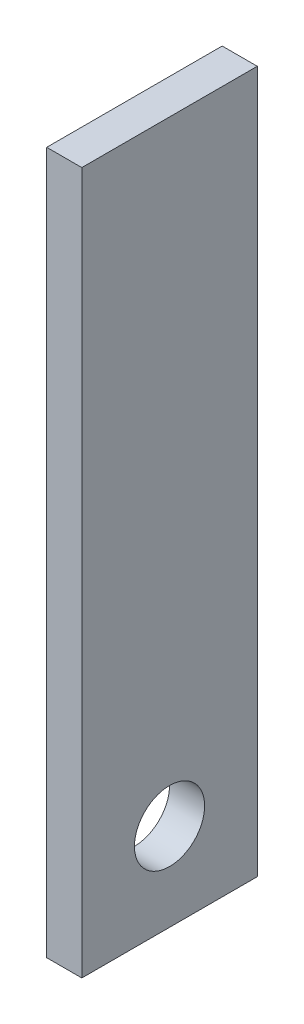
ISO-10303-21;
HEADER;
FILE_DESCRIPTION(('STEP AP214'),'2;1');
FILE_NAME('part.step','',(''),(''),'','','');
FILE_SCHEMA(('AUTOMOTIVE_DESIGN { 1 0 10303 214 1 1 1 1 }'));
ENDSEC;
DATA;
#1=APPLICATION_CONTEXT('core data for automotive mechanical design processes');
#2=APPLICATION_PROTOCOL_DEFINITION('international standard','automotive_design',2000,#1);
#3=PRODUCT_CONTEXT('',#1,'mechanical');
#4=PRODUCT('Part','Part','',(#3));
#5=PRODUCT_RELATED_PRODUCT_CATEGORY('part','',(#4));
#6=PRODUCT_DEFINITION_FORMATION('','',#4);
#7=PRODUCT_DEFINITION_CONTEXT('part definition',#1,'design');
#8=PRODUCT_DEFINITION('design','',#6,#7);
#9=PRODUCT_DEFINITION_SHAPE('','',#8);
#10=(LENGTH_UNIT() NAMED_UNIT(*) SI_UNIT(.MILLI.,.METRE.));
#11=(NAMED_UNIT(*) PLANE_ANGLE_UNIT() SI_UNIT($,.RADIAN.));
#12=(NAMED_UNIT(*) SI_UNIT($,.STERADIAN.) SOLID_ANGLE_UNIT());
#13=UNCERTAINTY_MEASURE_WITH_UNIT(LENGTH_MEASURE(1.E-05),#10,'distance_accuracy_value','');
#14=(GEOMETRIC_REPRESENTATION_CONTEXT(3) GLOBAL_UNCERTAINTY_ASSIGNED_CONTEXT((#13)) GLOBAL_UNIT_ASSIGNED_CONTEXT((#10,
#11,#12)) REPRESENTATION_CONTEXT('',''));
#15=CARTESIAN_POINT('',(0.,0.,0.));
#16=DIRECTION('',(0.,0.,1.));
#17=DIRECTION('',(1.,0.,0.));
#18=AXIS2_PLACEMENT_3D('',#15,#16,#17);
#19=CARTESIAN_POINT('',(5.00000000000002,-200.,0.));
#20=DIRECTION('',(0.,1.,0.));
#21=DIRECTION('',(-1.,0.,0.));
#22=AXIS2_PLACEMENT_3D('',#19,#20,#21);
#23=PLANE('',#22);
#24=DIRECTION('',(1.,0.,0.));
#25=VECTOR('',#24,1.);
#26=CARTESIAN_POINT('',(-43.,-200.000000000001,-25.));
#27=LINE('',#26,#25);
#28=CARTESIAN_POINT('',(-53.,-200.,-25.0000000000002));
#29=VERTEX_POINT('',#28);
#30=CARTESIAN_POINT('',(-43.,-200.000000000001,-25.));
#31=VERTEX_POINT('',#30);
#32=EDGE_CURVE('E119',#29,#31,#27,.T.);
#33=ORIENTED_EDGE('',*,*,#32,.T.);
#34=DIRECTION('',(0.,0.,1.));
#35=VECTOR('',#34,1.);
#36=CARTESIAN_POINT('',(-43.,-200.000000000001,-25.));
#37=LINE('',#36,#35);
#38=CARTESIAN_POINT('',(-43.,-200.,25.));
#39=VERTEX_POINT('',#38);
#40=EDGE_CURVE('E116',#31,#39,#37,.T.);
#41=ORIENTED_EDGE('',*,*,#40,.T.);
#42=DIRECTION('',(-1.,0.,0.));
#43=VECTOR('',#42,1.);
#44=CARTESIAN_POINT('',(-53.,-200.,25.0000000000002));
#45=LINE('',#44,#43);
#46=CARTESIAN_POINT('',(-53.,-200.,25.0000000000002));
#47=VERTEX_POINT('',#46);
#48=EDGE_CURVE('E130',#39,#47,#45,.T.);
#49=ORIENTED_EDGE('',*,*,#48,.T.);
#50=DIRECTION('',(0.,0.,-1.));
#51=VECTOR('',#50,1.);
#52=CARTESIAN_POINT('',(-53.,-200.,-25.0000000000002));
#53=LINE('',#52,#51);
#54=EDGE_CURVE('E64',#47,#29,#53,.T.);
#55=ORIENTED_EDGE('',*,*,#54,.T.);
#56=EDGE_LOOP('',(#33,#41,#49,#55));
#57=FACE_BOUND('',#56,.T.);
#58=ADVANCED_FACE('F40',(#57),#23,.F.);
#59=CARTESIAN_POINT('',(-53.,-200.,-25.0000000000002));
#60=DIRECTION('',(1.,0.,0.));
#61=DIRECTION('',(0.,1.,0.));
#62=AXIS2_PLACEMENT_3D('',#59,#60,#61);
#63=PLANE('',#62);
#64=CARTESIAN_POINT('',(-53.,-175.,0.));
#65=DIRECTION('',(-1.,0.,0.));
#66=DIRECTION('',(0.,0.,1.));
#67=AXIS2_PLACEMENT_3D('',#64,#65,#66);
#68=CIRCLE('',#67,9.99999999999998);
#69=CARTESIAN_POINT('',(-53.,-175.,10.0000000000001));
#70=VERTEX_POINT('',#69);
#71=EDGE_CURVE('E139',#70,#70,#68,.T.);
#72=ORIENTED_EDGE('',*,*,#71,.F.);
#73=EDGE_LOOP('',(#72));
#74=FACE_BOUND('',#73,.T.);
#75=DIRECTION('',(0.,0.,1.));
#76=VECTOR('',#75,1.);
#77=CARTESIAN_POINT('',(-53.,0.,-25.));
#78=LINE('',#77,#76);
#79=CARTESIAN_POINT('',(-53.,0.,-25.));
#80=VERTEX_POINT('',#79);
#81=CARTESIAN_POINT('',(-53.,0.,25.0000000000001));
#82=VERTEX_POINT('',#81);
#83=EDGE_CURVE('E11',#80,#82,#78,.T.);
#84=ORIENTED_EDGE('',*,*,#83,.F.);
#85=DIRECTION('',(0.,1.,0.));
#86=VECTOR('',#85,1.);
#87=CARTESIAN_POINT('',(-53.,-200.,-25.0000000000002));
#88=LINE('',#87,#86);
#89=EDGE_CURVE('E99',#29,#80,#88,.T.);
#90=ORIENTED_EDGE('',*,*,#89,.F.);
#91=ORIENTED_EDGE('',*,*,#54,.F.);
#92=DIRECTION('',(0.,1.,0.));
#93=VECTOR('',#92,1.);
#94=CARTESIAN_POINT('',(-53.,-200.,25.0000000000002));
#95=LINE('',#94,#93);
#96=EDGE_CURVE('E92',#47,#82,#95,.T.);
#97=ORIENTED_EDGE('',*,*,#96,.T.);
#98=EDGE_LOOP('',(#84,#90,#91,#97));
#99=FACE_BOUND('',#98,.T.);
#100=ADVANCED_FACE('F97',(#74,#99),#63,.F.);
#101=CARTESIAN_POINT('',(-53.,-200.,25.0000000000002));
#102=DIRECTION('',(0.,0.,-1.));
#103=DIRECTION('',(-1.,0.,0.));
#104=AXIS2_PLACEMENT_3D('',#101,#102,#103);
#105=PLANE('',#104);
#106=DIRECTION('',(1.,0.,0.));
#107=VECTOR('',#106,1.);
#108=CARTESIAN_POINT('',(-53.,0.,25.0000000000001));
#109=LINE('',#108,#107);
#110=CARTESIAN_POINT('',(-43.,0.,25.0000000000001));
#111=VERTEX_POINT('',#110);
#112=EDGE_CURVE('E82',#82,#111,#109,.T.);
#113=ORIENTED_EDGE('',*,*,#112,.F.);
#114=ORIENTED_EDGE('',*,*,#96,.F.);
#115=ORIENTED_EDGE('',*,*,#48,.F.);
#116=DIRECTION('',(0.,1.,0.));
#117=VECTOR('',#116,1.);
#118=CARTESIAN_POINT('',(-43.,-200.,25.));
#119=LINE('',#118,#117);
#120=EDGE_CURVE('E94',#39,#111,#119,.T.);
#121=ORIENTED_EDGE('',*,*,#120,.T.);
#122=EDGE_LOOP('',(#113,#114,#115,#121));
#123=FACE_BOUND('',#122,.T.);
#124=ADVANCED_FACE('F90',(#123),#105,.F.);
#125=CARTESIAN_POINT('',(-43.,-200.000000000001,-25.));
#126=DIRECTION('',(-1.,0.,0.));
#127=DIRECTION('',(0.,-1.,0.));
#128=AXIS2_PLACEMENT_3D('',#125,#126,#127);
#129=PLANE('',#128);
#130=CARTESIAN_POINT('',(-43.,-175.,0.));
#131=DIRECTION('',(-1.,0.,0.));
#132=DIRECTION('',(0.,-1.,0.));
#133=AXIS2_PLACEMENT_3D('',#130,#131,#132);
#134=CIRCLE('',#133,9.99999999999998);
#135=CARTESIAN_POINT('',(-43.,-185.,0.));
#136=VERTEX_POINT('',#135);
#137=EDGE_CURVE('E44',#136,#136,#134,.T.);
#138=ORIENTED_EDGE('',*,*,#137,.T.);
#139=EDGE_LOOP('',(#138));
#140=FACE_BOUND('',#139,.T.);
#141=DIRECTION('',(0.,0.,-1.));
#142=VECTOR('',#141,1.);
#143=CARTESIAN_POINT('',(-43.,0.,-25.0000000000001));
#144=LINE('',#143,#142);
#145=CARTESIAN_POINT('',(-43.,0.,-25.));
#146=VERTEX_POINT('',#145);
#147=EDGE_CURVE('E115',#111,#146,#144,.T.);
#148=ORIENTED_EDGE('',*,*,#147,.F.);
#149=ORIENTED_EDGE('',*,*,#120,.F.);
#150=ORIENTED_EDGE('',*,*,#40,.F.);
#151=DIRECTION('',(0.,1.,0.));
#152=VECTOR('',#151,1.);
#153=CARTESIAN_POINT('',(-43.,-200.000000000001,-25.));
#154=LINE('',#153,#152);
#155=EDGE_CURVE('E50',#31,#146,#154,.T.);
#156=ORIENTED_EDGE('',*,*,#155,.T.);
#157=EDGE_LOOP('',(#148,#149,#150,#156));
#158=FACE_BOUND('',#157,.T.);
#159=ADVANCED_FACE('F114',(#140,#158),#129,.F.);
#160=CARTESIAN_POINT('',(-43.,-200.000000000001,-25.));
#161=DIRECTION('',(0.,0.,1.));
#162=DIRECTION('',(1.,0.,0.));
#163=AXIS2_PLACEMENT_3D('',#160,#161,#162);
#164=PLANE('',#163);
#165=DIRECTION('',(1.,0.,0.));
#166=VECTOR('',#165,1.);
#167=CARTESIAN_POINT('',(-53.,0.,-25.));
#168=LINE('',#167,#166);
#169=EDGE_CURVE('E56',#80,#146,#168,.T.);
#170=ORIENTED_EDGE('',*,*,#169,.T.);
#171=ORIENTED_EDGE('',*,*,#155,.F.);
#172=ORIENTED_EDGE('',*,*,#32,.F.);
#173=ORIENTED_EDGE('',*,*,#89,.T.);
#174=EDGE_LOOP('',(#170,#171,#172,#173));
#175=FACE_BOUND('',#174,.T.);
#176=ADVANCED_FACE('F42',(#175),#164,.F.);
#177=CARTESIAN_POINT('',(-53.,0.,-25.));
#178=DIRECTION('',(0.,1.,0.));
#179=DIRECTION('',(-1.,0.,0.));
#180=AXIS2_PLACEMENT_3D('',#177,#178,#179);
#181=PLANE('',#180);
#182=ORIENTED_EDGE('',*,*,#147,.T.);
#183=ORIENTED_EDGE('',*,*,#169,.F.);
#184=ORIENTED_EDGE('',*,*,#83,.T.);
#185=ORIENTED_EDGE('',*,*,#112,.T.);
#186=EDGE_LOOP('',(#182,#183,#184,#185));
#187=FACE_BOUND('',#186,.T.);
#188=ADVANCED_FACE('F81',(#187),#181,.T.);
#189=CARTESIAN_POINT('',(-53.,-175.,0.));
#190=DIRECTION('',(-1.,0.,0.));
#191=DIRECTION('',(0.,0.,1.));
#192=AXIS2_PLACEMENT_3D('',#189,#190,#191);
#193=CYLINDRICAL_SURFACE('',#192,9.99999999999998);
#194=ORIENTED_EDGE('',*,*,#71,.T.);
#195=EDGE_LOOP('',(#194));
#196=FACE_BOUND('',#195,.T.);
#197=ORIENTED_EDGE('',*,*,#137,.F.);
#198=EDGE_LOOP('',(#197));
#199=FACE_BOUND('',#198,.T.);
#200=ADVANCED_FACE('F144',(#196,#199),#193,.F.);
#201=CLOSED_SHELL('',(#58,#100,#124,#159,#176,#188,#200));
#202=MANIFOLD_SOLID_BREP('B2',#201);
#203=ADVANCED_BREP_SHAPE_REPRESENTATION('',(#18,#202),#14);
#204=SHAPE_DEFINITION_REPRESENTATION(#9,#203);
ENDSEC;
END-ISO-10303-21;
